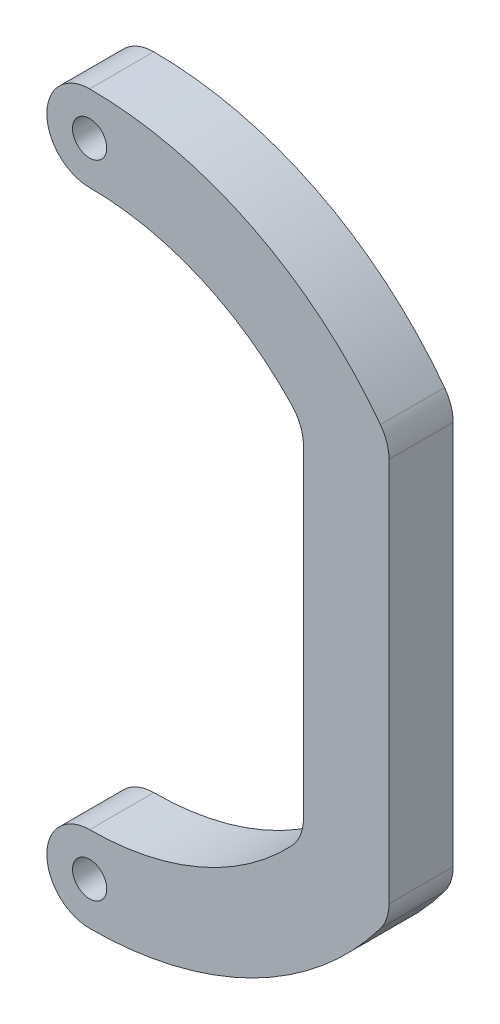
ISO-10303-21;
HEADER;
FILE_DESCRIPTION(('STEP AP214'),'2;1');
FILE_NAME('part.step','',(''),(''),'','','');
FILE_SCHEMA(('AUTOMOTIVE_DESIGN { 1 0 10303 214 1 1 1 1 }'));
ENDSEC;
DATA;
#1=APPLICATION_CONTEXT('core data for automotive mechanical design processes');
#2=APPLICATION_PROTOCOL_DEFINITION('international standard','automotive_design',2000,#1);
#3=PRODUCT_CONTEXT('',#1,'mechanical');
#4=PRODUCT('Part','Part','',(#3));
#5=PRODUCT_RELATED_PRODUCT_CATEGORY('part','',(#4));
#6=PRODUCT_DEFINITION_FORMATION('','',#4);
#7=PRODUCT_DEFINITION_CONTEXT('part definition',#1,'design');
#8=PRODUCT_DEFINITION('design','',#6,#7);
#9=PRODUCT_DEFINITION_SHAPE('','',#8);
#10=(LENGTH_UNIT() NAMED_UNIT(*) SI_UNIT(.MILLI.,.METRE.));
#11=(NAMED_UNIT(*) PLANE_ANGLE_UNIT() SI_UNIT($,.RADIAN.));
#12=(NAMED_UNIT(*) SI_UNIT($,.STERADIAN.) SOLID_ANGLE_UNIT());
#13=UNCERTAINTY_MEASURE_WITH_UNIT(LENGTH_MEASURE(1.E-05),#10,'distance_accuracy_value','');
#14=(GEOMETRIC_REPRESENTATION_CONTEXT(3) GLOBAL_UNCERTAINTY_ASSIGNED_CONTEXT((#13)) GLOBAL_UNIT_ASSIGNED_CONTEXT((#10,
#11,#12)) REPRESENTATION_CONTEXT('',''));
#15=CARTESIAN_POINT('',(0.,0.,0.));
#16=DIRECTION('',(0.,0.,1.));
#17=DIRECTION('',(1.,0.,0.));
#18=AXIS2_PLACEMENT_3D('',#15,#16,#17);
#19=CARTESIAN_POINT('',(-75.,-142.,15.));
#20=DIRECTION('',(0.,0.,-1.));
#21=DIRECTION('',(-1.,0.,0.));
#22=AXIS2_PLACEMENT_3D('',#19,#20,#21);
#23=PLANE('',#22);
#24=CARTESIAN_POINT('',(-75.,-142.,15.));
#25=DIRECTION('',(0.,0.,1.));
#26=DIRECTION('',(1.,0.,0.));
#27=AXIS2_PLACEMENT_3D('',#24,#25,#26);
#28=CIRCLE('',#27,3.99999999999999);
#29=CARTESIAN_POINT('',(-71.,-142.,15.));
#30=VERTEX_POINT('',#29);
#31=EDGE_CURVE('E157',#30,#30,#28,.T.);
#32=ORIENTED_EDGE('',*,*,#31,.F.);
#33=EDGE_LOOP('',(#32));
#34=FACE_BOUND('',#33,.T.);
#35=CARTESIAN_POINT('',(-75.,-142.,15.));
#36=DIRECTION('',(0.,0.,1.));
#37=DIRECTION('',(-1.,0.,0.));
#38=AXIS2_PLACEMENT_3D('',#35,#36,#37);
#39=CIRCLE('',#38,10.);
#40=CARTESIAN_POINT('',(-75.,-132.,15.));
#41=VERTEX_POINT('',#40);
#42=CARTESIAN_POINT('',(-75.,-152.,15.));
#43=VERTEX_POINT('',#42);
#44=EDGE_CURVE('E176',#41,#43,#39,.T.);
#45=ORIENTED_EDGE('',*,*,#44,.T.);
#46=CARTESIAN_POINT('',(-75.,-67.,15.));
#47=DIRECTION('',(0.,0.,1.));
#48=DIRECTION('',(1.,0.,0.));
#49=AXIS2_PLACEMENT_3D('',#46,#47,#48);
#50=CIRCLE('',#49,85.);
#51=CARTESIAN_POINT('',(-6.99999999999999,-118.,15.));
#52=VERTEX_POINT('',#51);
#53=EDGE_CURVE('E104',#43,#52,#50,.T.);
#54=ORIENTED_EDGE('',*,*,#53,.T.);
#55=CARTESIAN_POINT('',(-15.,-112.,15.));
#56=DIRECTION('',(0.,0.,1.));
#57=DIRECTION('',(1.,0.,0.));
#58=AXIS2_PLACEMENT_3D('',#55,#56,#57);
#59=CIRCLE('',#58,10.);
#60=CARTESIAN_POINT('',(-4.99999999999999,-112.,15.));
#61=VERTEX_POINT('',#60);
#62=EDGE_CURVE('E203',#52,#61,#59,.T.);
#63=ORIENTED_EDGE('',*,*,#62,.T.);
#64=DIRECTION('',(0.,1.,0.));
#65=VECTOR('',#64,1.);
#66=CARTESIAN_POINT('',(-4.99999999999999,-22.,15.));
#67=LINE('',#66,#65);
#68=CARTESIAN_POINT('',(-4.99999999999999,-22.,15.));
#69=VERTEX_POINT('',#68);
#70=EDGE_CURVE('E222',#61,#69,#67,.T.);
#71=ORIENTED_EDGE('',*,*,#70,.T.);
#72=CARTESIAN_POINT('',(-15.,-22.,15.));
#73=DIRECTION('',(0.,0.,1.));
#74=DIRECTION('',(-1.,0.,0.));
#75=AXIS2_PLACEMENT_3D('',#72,#73,#74);
#76=CIRCLE('',#75,10.);
#77=CARTESIAN_POINT('',(-6.99999999999999,-16.,15.));
#78=VERTEX_POINT('',#77);
#79=EDGE_CURVE('E219',#69,#78,#76,.T.);
#80=ORIENTED_EDGE('',*,*,#79,.T.);
#81=CARTESIAN_POINT('',(-75.,-67.,15.));
#82=DIRECTION('',(0.,0.,1.));
#83=DIRECTION('',(1.,0.,0.));
#84=AXIS2_PLACEMENT_3D('',#81,#82,#83);
#85=CIRCLE('',#84,85.);
#86=CARTESIAN_POINT('',(-74.9999999999999,18.,15.));
#87=VERTEX_POINT('',#86);
#88=EDGE_CURVE('E221',#78,#87,#85,.T.);
#89=ORIENTED_EDGE('',*,*,#88,.T.);
#90=CARTESIAN_POINT('',(-75.,7.99999999999998,15.));
#91=DIRECTION('',(0.,0.,1.));
#92=DIRECTION('',(1.,0.,0.));
#93=AXIS2_PLACEMENT_3D('',#90,#91,#92);
#94=CIRCLE('',#93,9.99999999999999);
#95=CARTESIAN_POINT('',(-75.,-2.00000000000002,15.));
#96=VERTEX_POINT('',#95);
#97=EDGE_CURVE('E224',#87,#96,#94,.T.);
#98=ORIENTED_EDGE('',*,*,#97,.T.);
#99=CARTESIAN_POINT('',(-75.,-67.,15.));
#100=DIRECTION('',(0.,0.,-1.));
#101=DIRECTION('',(1.,0.,0.));
#102=AXIS2_PLACEMENT_3D('',#99,#100,#101);
#103=CIRCLE('',#102,65.);
#104=CARTESIAN_POINT('',(-27.7272727272727,-22.3873419734002,15.));
#105=VERTEX_POINT('',#104);
#106=EDGE_CURVE('E230',#96,#105,#103,.T.);
#107=ORIENTED_EDGE('',*,*,#106,.T.);
#108=CARTESIAN_POINT('',(-35.,-29.2508278236463,15.));
#109=DIRECTION('',(0.,0.,-1.));
#110=DIRECTION('',(1.,0.,0.));
#111=AXIS2_PLACEMENT_3D('',#108,#109,#110);
#112=CIRCLE('',#111,10.);
#113=CARTESIAN_POINT('',(-25.,-29.2508278236463,15.));
#114=VERTEX_POINT('',#113);
#115=EDGE_CURVE('E135',#105,#114,#112,.T.);
#116=ORIENTED_EDGE('',*,*,#115,.T.);
#117=DIRECTION('',(0.,-1.,0.));
#118=VECTOR('',#117,1.);
#119=CARTESIAN_POINT('',(-25.,-29.2508278236463,15.));
#120=LINE('',#119,#118);
#121=CARTESIAN_POINT('',(-25.,-104.749172176354,15.));
#122=VERTEX_POINT('',#121);
#123=EDGE_CURVE('E129',#114,#122,#120,.T.);
#124=ORIENTED_EDGE('',*,*,#123,.T.);
#125=CARTESIAN_POINT('',(-35.,-104.749172176354,15.));
#126=DIRECTION('',(0.,0.,-1.));
#127=DIRECTION('',(1.,0.,0.));
#128=AXIS2_PLACEMENT_3D('',#125,#126,#127);
#129=CIRCLE('',#128,10.);
#130=CARTESIAN_POINT('',(-27.7272727272727,-111.6126580266,15.));
#131=VERTEX_POINT('',#130);
#132=EDGE_CURVE('E133',#122,#131,#129,.T.);
#133=ORIENTED_EDGE('',*,*,#132,.T.);
#134=CARTESIAN_POINT('',(-75.,-67.,15.));
#135=DIRECTION('',(0.,0.,-1.));
#136=DIRECTION('',(1.,0.,0.));
#137=AXIS2_PLACEMENT_3D('',#134,#135,#136);
#138=CIRCLE('',#137,65.);
#139=EDGE_CURVE('E49',#131,#41,#138,.T.);
#140=ORIENTED_EDGE('',*,*,#139,.T.);
#141=EDGE_LOOP('',(#45,#54,#63,#71,#80,#89,#98,#107,#116,#124,#133,#140));
#142=FACE_BOUND('',#141,.T.);
#143=CARTESIAN_POINT('',(-75.,7.99999999999998,15.));
#144=DIRECTION('',(0.,0.,1.));
#145=DIRECTION('',(1.,0.,0.));
#146=AXIS2_PLACEMENT_3D('',#143,#144,#145);
#147=CIRCLE('',#146,4.00000000000001);
#148=CARTESIAN_POINT('',(-71.,7.99999999999998,15.));
#149=VERTEX_POINT('',#148);
#150=EDGE_CURVE('E273',#149,#149,#147,.T.);
#151=ORIENTED_EDGE('',*,*,#150,.F.);
#152=EDGE_LOOP('',(#151));
#153=FACE_BOUND('',#152,.T.);
#154=ADVANCED_FACE('F32',(#34,#142,#153),#23,.F.);
#155=CARTESIAN_POINT('',(-75.,-142.,0.));
#156=DIRECTION('',(0.,0.,-1.));
#157=DIRECTION('',(-1.,0.,0.));
#158=AXIS2_PLACEMENT_3D('',#155,#156,#157);
#159=PLANE('',#158);
#160=CARTESIAN_POINT('',(-75.,-142.,0.));
#161=DIRECTION('',(0.,0.,1.));
#162=DIRECTION('',(1.,0.,0.));
#163=AXIS2_PLACEMENT_3D('',#160,#161,#162);
#164=CIRCLE('',#163,3.99999999999999);
#165=CARTESIAN_POINT('',(-71.,-142.,0.));
#166=VERTEX_POINT('',#165);
#167=EDGE_CURVE('E278',#166,#166,#164,.T.);
#168=ORIENTED_EDGE('',*,*,#167,.T.);
#169=EDGE_LOOP('',(#168));
#170=FACE_BOUND('',#169,.T.);
#171=CARTESIAN_POINT('',(-75.,-142.,0.));
#172=DIRECTION('',(0.,0.,1.));
#173=DIRECTION('',(-1.,0.,0.));
#174=AXIS2_PLACEMENT_3D('',#171,#172,#173);
#175=CIRCLE('',#174,10.);
#176=CARTESIAN_POINT('',(-75.,-132.,0.));
#177=VERTEX_POINT('',#176);
#178=CARTESIAN_POINT('',(-75.,-152.,0.));
#179=VERTEX_POINT('',#178);
#180=EDGE_CURVE('E153',#177,#179,#175,.T.);
#181=ORIENTED_EDGE('',*,*,#180,.F.);
#182=CARTESIAN_POINT('',(-75.,-67.,0.));
#183=DIRECTION('',(0.,0.,-1.));
#184=DIRECTION('',(1.,0.,0.));
#185=AXIS2_PLACEMENT_3D('',#182,#183,#184);
#186=CIRCLE('',#185,65.);
#187=CARTESIAN_POINT('',(-27.7272727272727,-111.6126580266,0.));
#188=VERTEX_POINT('',#187);
#189=EDGE_CURVE('E96',#188,#177,#186,.T.);
#190=ORIENTED_EDGE('',*,*,#189,.F.);
#191=CARTESIAN_POINT('',(-35.,-104.749172176354,0.));
#192=DIRECTION('',(0.,0.,-1.));
#193=DIRECTION('',(1.,0.,0.));
#194=AXIS2_PLACEMENT_3D('',#191,#192,#193);
#195=CIRCLE('',#194,10.);
#196=CARTESIAN_POINT('',(-25.,-104.749172176354,0.));
#197=VERTEX_POINT('',#196);
#198=EDGE_CURVE('E90',#197,#188,#195,.T.);
#199=ORIENTED_EDGE('',*,*,#198,.F.);
#200=DIRECTION('',(0.,-1.,0.));
#201=VECTOR('',#200,1.);
#202=CARTESIAN_POINT('',(-25.,-29.2508278236463,0.));
#203=LINE('',#202,#201);
#204=CARTESIAN_POINT('',(-25.,-29.2508278236463,0.));
#205=VERTEX_POINT('',#204);
#206=EDGE_CURVE('E143',#205,#197,#203,.T.);
#207=ORIENTED_EDGE('',*,*,#206,.F.);
#208=CARTESIAN_POINT('',(-35.,-29.2508278236463,0.));
#209=DIRECTION('',(0.,0.,-1.));
#210=DIRECTION('',(1.,0.,0.));
#211=AXIS2_PLACEMENT_3D('',#208,#209,#210);
#212=CIRCLE('',#211,10.);
#213=CARTESIAN_POINT('',(-27.7272727272727,-22.3873419734002,0.));
#214=VERTEX_POINT('',#213);
#215=EDGE_CURVE('E171',#214,#205,#212,.T.);
#216=ORIENTED_EDGE('',*,*,#215,.F.);
#217=CARTESIAN_POINT('',(-75.,-67.,0.));
#218=DIRECTION('',(0.,0.,-1.));
#219=DIRECTION('',(1.,0.,0.));
#220=AXIS2_PLACEMENT_3D('',#217,#218,#219);
#221=CIRCLE('',#220,65.);
#222=CARTESIAN_POINT('',(-75.,-2.00000000000002,0.));
#223=VERTEX_POINT('',#222);
#224=EDGE_CURVE('E169',#223,#214,#221,.T.);
#225=ORIENTED_EDGE('',*,*,#224,.F.);
#226=CARTESIAN_POINT('',(-75.,7.99999999999998,0.));
#227=DIRECTION('',(0.,0.,1.));
#228=DIRECTION('',(1.,0.,0.));
#229=AXIS2_PLACEMENT_3D('',#226,#227,#228);
#230=CIRCLE('',#229,9.99999999999999);
#231=CARTESIAN_POINT('',(-74.9999999999999,18.,0.));
#232=VERTEX_POINT('',#231);
#233=EDGE_CURVE('E167',#232,#223,#230,.T.);
#234=ORIENTED_EDGE('',*,*,#233,.F.);
#235=CARTESIAN_POINT('',(-75.,-67.,0.));
#236=DIRECTION('',(0.,0.,1.));
#237=DIRECTION('',(1.,0.,0.));
#238=AXIS2_PLACEMENT_3D('',#235,#236,#237);
#239=CIRCLE('',#238,85.);
#240=CARTESIAN_POINT('',(-6.99999999999999,-16.,0.));
#241=VERTEX_POINT('',#240);
#242=EDGE_CURVE('E165',#241,#232,#239,.T.);
#243=ORIENTED_EDGE('',*,*,#242,.F.);
#244=CARTESIAN_POINT('',(-15.,-22.,0.));
#245=DIRECTION('',(0.,0.,1.));
#246=DIRECTION('',(-1.,0.,0.));
#247=AXIS2_PLACEMENT_3D('',#244,#245,#246);
#248=CIRCLE('',#247,10.);
#249=CARTESIAN_POINT('',(-4.99999999999999,-22.,0.));
#250=VERTEX_POINT('',#249);
#251=EDGE_CURVE('E163',#250,#241,#248,.T.);
#252=ORIENTED_EDGE('',*,*,#251,.F.);
#253=DIRECTION('',(0.,1.,0.));
#254=VECTOR('',#253,1.);
#255=CARTESIAN_POINT('',(-4.99999999999999,-22.,0.));
#256=LINE('',#255,#254);
#257=CARTESIAN_POINT('',(-4.99999999999999,-112.,0.));
#258=VERTEX_POINT('',#257);
#259=EDGE_CURVE('E161',#258,#250,#256,.T.);
#260=ORIENTED_EDGE('',*,*,#259,.F.);
#261=CARTESIAN_POINT('',(-15.,-112.,0.));
#262=DIRECTION('',(0.,0.,1.));
#263=DIRECTION('',(1.,0.,0.));
#264=AXIS2_PLACEMENT_3D('',#261,#262,#263);
#265=CIRCLE('',#264,10.);
#266=CARTESIAN_POINT('',(-6.99999999999999,-118.,0.));
#267=VERTEX_POINT('',#266);
#268=EDGE_CURVE('E159',#267,#258,#265,.T.);
#269=ORIENTED_EDGE('',*,*,#268,.F.);
#270=CARTESIAN_POINT('',(-75.,-67.,0.));
#271=DIRECTION('',(0.,0.,1.));
#272=DIRECTION('',(1.,0.,0.));
#273=AXIS2_PLACEMENT_3D('',#270,#271,#272);
#274=CIRCLE('',#273,85.);
#275=EDGE_CURVE('E156',#179,#267,#274,.T.);
#276=ORIENTED_EDGE('',*,*,#275,.F.);
#277=EDGE_LOOP('',(#181,#190,#199,#207,#216,#225,#234,#243,#252,#260,#269,#276));
#278=FACE_BOUND('',#277,.T.);
#279=CARTESIAN_POINT('',(-75.,7.99999999999998,0.));
#280=DIRECTION('',(0.,0.,1.));
#281=DIRECTION('',(1.,0.,0.));
#282=AXIS2_PLACEMENT_3D('',#279,#280,#281);
#283=CIRCLE('',#282,4.00000000000001);
#284=CARTESIAN_POINT('',(-71.,7.99999999999998,0.));
#285=VERTEX_POINT('',#284);
#286=EDGE_CURVE('E276',#285,#285,#283,.T.);
#287=ORIENTED_EDGE('',*,*,#286,.T.);
#288=EDGE_LOOP('',(#287));
#289=FACE_BOUND('',#288,.T.);
#290=ADVANCED_FACE('F207',(#170,#278,#289),#159,.T.);
#291=CARTESIAN_POINT('',(-75.,-142.,15.));
#292=DIRECTION('',(0.,0.,-1.));
#293=DIRECTION('',(-1.,0.,0.));
#294=AXIS2_PLACEMENT_3D('',#291,#292,#293);
#295=CYLINDRICAL_SURFACE('',#294,10.);
#296=ORIENTED_EDGE('',*,*,#180,.T.);
#297=DIRECTION('',(0.,0.,-1.));
#298=VECTOR('',#297,1.);
#299=CARTESIAN_POINT('',(-75.,-152.,15.));
#300=LINE('',#299,#298);
#301=EDGE_CURVE('E11',#43,#179,#300,.T.);
#302=ORIENTED_EDGE('',*,*,#301,.F.);
#303=ORIENTED_EDGE('',*,*,#44,.F.);
#304=DIRECTION('',(0.,0.,-1.));
#305=VECTOR('',#304,1.);
#306=CARTESIAN_POINT('',(-75.,-132.,15.));
#307=LINE('',#306,#305);
#308=EDGE_CURVE('E149',#41,#177,#307,.T.);
#309=ORIENTED_EDGE('',*,*,#308,.T.);
#310=EDGE_LOOP('',(#296,#302,#303,#309));
#311=FACE_BOUND('',#310,.T.);
#312=ADVANCED_FACE('F34',(#311),#295,.T.);
#313=CARTESIAN_POINT('',(-75.,-67.,15.));
#314=DIRECTION('',(0.,0.,-1.));
#315=DIRECTION('',(-1.,0.,0.));
#316=AXIS2_PLACEMENT_3D('',#313,#314,#315);
#317=CYLINDRICAL_SURFACE('',#316,85.);
#318=ORIENTED_EDGE('',*,*,#275,.T.);
#319=DIRECTION('',(0.,0.,-1.));
#320=VECTOR('',#319,1.);
#321=CARTESIAN_POINT('',(-6.99999999999999,-118.,15.));
#322=LINE('',#321,#320);
#323=EDGE_CURVE('E41',#52,#267,#322,.T.);
#324=ORIENTED_EDGE('',*,*,#323,.F.);
#325=ORIENTED_EDGE('',*,*,#53,.F.);
#326=ORIENTED_EDGE('',*,*,#301,.T.);
#327=EDGE_LOOP('',(#318,#324,#325,#326));
#328=FACE_BOUND('',#327,.T.);
#329=ADVANCED_FACE('F371',(#328),#317,.T.);
#330=CARTESIAN_POINT('',(-15.,-112.,15.));
#331=DIRECTION('',(0.,0.,-1.));
#332=DIRECTION('',(-1.,0.,0.));
#333=AXIS2_PLACEMENT_3D('',#330,#331,#332);
#334=CYLINDRICAL_SURFACE('',#333,10.);
#335=ORIENTED_EDGE('',*,*,#268,.T.);
#336=DIRECTION('',(0.,0.,-1.));
#337=VECTOR('',#336,1.);
#338=CARTESIAN_POINT('',(-4.99999999999999,-112.,15.));
#339=LINE('',#338,#337);
#340=EDGE_CURVE('E195',#61,#258,#339,.T.);
#341=ORIENTED_EDGE('',*,*,#340,.F.);
#342=ORIENTED_EDGE('',*,*,#62,.F.);
#343=ORIENTED_EDGE('',*,*,#323,.T.);
#344=EDGE_LOOP('',(#335,#341,#342,#343));
#345=FACE_BOUND('',#344,.T.);
#346=ADVANCED_FACE('F201',(#345),#334,.T.);
#347=CARTESIAN_POINT('',(-4.99999999999999,-22.,15.));
#348=DIRECTION('',(-1.,0.,0.));
#349=DIRECTION('',(0.,0.,1.));
#350=AXIS2_PLACEMENT_3D('',#347,#348,#349);
#351=PLANE('',#350);
#352=ORIENTED_EDGE('',*,*,#259,.T.);
#353=DIRECTION('',(0.,0.,-1.));
#354=VECTOR('',#353,1.);
#355=CARTESIAN_POINT('',(-4.99999999999999,-22.,15.));
#356=LINE('',#355,#354);
#357=EDGE_CURVE('E192',#69,#250,#356,.T.);
#358=ORIENTED_EDGE('',*,*,#357,.F.);
#359=ORIENTED_EDGE('',*,*,#70,.F.);
#360=ORIENTED_EDGE('',*,*,#340,.T.);
#361=EDGE_LOOP('',(#352,#358,#359,#360));
#362=FACE_BOUND('',#361,.T.);
#363=ADVANCED_FACE('F213',(#362),#351,.F.);
#364=CARTESIAN_POINT('',(-15.,-22.,15.));
#365=DIRECTION('',(0.,0.,-1.));
#366=DIRECTION('',(-1.,0.,0.));
#367=AXIS2_PLACEMENT_3D('',#364,#365,#366);
#368=CYLINDRICAL_SURFACE('',#367,10.);
#369=ORIENTED_EDGE('',*,*,#251,.T.);
#370=DIRECTION('',(0.,0.,-1.));
#371=VECTOR('',#370,1.);
#372=CARTESIAN_POINT('',(-6.99999999999999,-16.,15.));
#373=LINE('',#372,#371);
#374=EDGE_CURVE('E189',#78,#241,#373,.T.);
#375=ORIENTED_EDGE('',*,*,#374,.F.);
#376=ORIENTED_EDGE('',*,*,#79,.F.);
#377=ORIENTED_EDGE('',*,*,#357,.T.);
#378=EDGE_LOOP('',(#369,#375,#376,#377));
#379=FACE_BOUND('',#378,.T.);
#380=ADVANCED_FACE('F217',(#379),#368,.T.);
#381=CARTESIAN_POINT('',(-75.,-67.,15.));
#382=DIRECTION('',(0.,0.,-1.));
#383=DIRECTION('',(-1.,0.,0.));
#384=AXIS2_PLACEMENT_3D('',#381,#382,#383);
#385=CYLINDRICAL_SURFACE('',#384,85.);
#386=ORIENTED_EDGE('',*,*,#242,.T.);
#387=DIRECTION('',(0.,0.,-1.));
#388=VECTOR('',#387,1.);
#389=CARTESIAN_POINT('',(-74.9999999999999,18.,15.));
#390=LINE('',#389,#388);
#391=EDGE_CURVE('E186',#87,#232,#390,.T.);
#392=ORIENTED_EDGE('',*,*,#391,.F.);
#393=ORIENTED_EDGE('',*,*,#88,.F.);
#394=ORIENTED_EDGE('',*,*,#374,.T.);
#395=EDGE_LOOP('',(#386,#392,#393,#394));
#396=FACE_BOUND('',#395,.T.);
#397=ADVANCED_FACE('F336',(#396),#385,.T.);
#398=CARTESIAN_POINT('',(-75.,7.99999999999998,15.));
#399=DIRECTION('',(0.,0.,-1.));
#400=DIRECTION('',(-1.,0.,0.));
#401=AXIS2_PLACEMENT_3D('',#398,#399,#400);
#402=CYLINDRICAL_SURFACE('',#401,9.99999999999999);
#403=ORIENTED_EDGE('',*,*,#233,.T.);
#404=DIRECTION('',(0.,0.,-1.));
#405=VECTOR('',#404,1.);
#406=CARTESIAN_POINT('',(-75.,-2.00000000000002,15.));
#407=LINE('',#406,#405);
#408=EDGE_CURVE('E183',#96,#223,#407,.T.);
#409=ORIENTED_EDGE('',*,*,#408,.F.);
#410=ORIENTED_EDGE('',*,*,#97,.F.);
#411=ORIENTED_EDGE('',*,*,#391,.T.);
#412=EDGE_LOOP('',(#403,#409,#410,#411));
#413=FACE_BOUND('',#412,.T.);
#414=ADVANCED_FACE('F327',(#413),#402,.T.);
#415=CARTESIAN_POINT('',(-75.,-67.,15.));
#416=DIRECTION('',(0.,0.,-1.));
#417=DIRECTION('',(-1.,0.,0.));
#418=AXIS2_PLACEMENT_3D('',#415,#416,#417);
#419=CYLINDRICAL_SURFACE('',#418,65.);
#420=ORIENTED_EDGE('',*,*,#224,.T.);
#421=DIRECTION('',(0.,0.,-1.));
#422=VECTOR('',#421,1.);
#423=CARTESIAN_POINT('',(-27.7272727272727,-22.3873419734002,15.));
#424=LINE('',#423,#422);
#425=EDGE_CURVE('E180',#105,#214,#424,.T.);
#426=ORIENTED_EDGE('',*,*,#425,.F.);
#427=ORIENTED_EDGE('',*,*,#106,.F.);
#428=ORIENTED_EDGE('',*,*,#408,.T.);
#429=EDGE_LOOP('',(#420,#426,#427,#428));
#430=FACE_BOUND('',#429,.T.);
#431=ADVANCED_FACE('F236',(#430),#419,.F.);
#432=CARTESIAN_POINT('',(-35.,-29.2508278236463,15.));
#433=DIRECTION('',(0.,0.,-1.));
#434=DIRECTION('',(-1.,0.,0.));
#435=AXIS2_PLACEMENT_3D('',#432,#433,#434);
#436=CYLINDRICAL_SURFACE('',#435,10.);
#437=ORIENTED_EDGE('',*,*,#215,.T.);
#438=DIRECTION('',(0.,0.,-1.));
#439=VECTOR('',#438,1.);
#440=CARTESIAN_POINT('',(-25.,-29.2508278236463,15.));
#441=LINE('',#440,#439);
#442=EDGE_CURVE('E144',#114,#205,#441,.T.);
#443=ORIENTED_EDGE('',*,*,#442,.F.);
#444=ORIENTED_EDGE('',*,*,#115,.F.);
#445=ORIENTED_EDGE('',*,*,#425,.T.);
#446=EDGE_LOOP('',(#437,#443,#444,#445));
#447=FACE_BOUND('',#446,.T.);
#448=ADVANCED_FACE('F240',(#447),#436,.F.);
#449=CARTESIAN_POINT('',(-25.,-29.2508278236463,15.));
#450=DIRECTION('',(1.,0.,0.));
#451=DIRECTION('',(0.,0.,-1.));
#452=AXIS2_PLACEMENT_3D('',#449,#450,#451);
#453=PLANE('',#452);
#454=ORIENTED_EDGE('',*,*,#206,.T.);
#455=DIRECTION('',(0.,0.,-1.));
#456=VECTOR('',#455,1.);
#457=CARTESIAN_POINT('',(-25.,-104.749172176354,15.));
#458=LINE('',#457,#456);
#459=EDGE_CURVE('E140',#122,#197,#458,.T.);
#460=ORIENTED_EDGE('',*,*,#459,.F.);
#461=ORIENTED_EDGE('',*,*,#123,.F.);
#462=ORIENTED_EDGE('',*,*,#442,.T.);
#463=EDGE_LOOP('',(#454,#460,#461,#462));
#464=FACE_BOUND('',#463,.T.);
#465=ADVANCED_FACE('F141',(#464),#453,.F.);
#466=CARTESIAN_POINT('',(-35.,-104.749172176354,15.));
#467=DIRECTION('',(0.,0.,-1.));
#468=DIRECTION('',(-1.,0.,0.));
#469=AXIS2_PLACEMENT_3D('',#466,#467,#468);
#470=CYLINDRICAL_SURFACE('',#469,10.);
#471=ORIENTED_EDGE('',*,*,#198,.T.);
#472=DIRECTION('',(0.,0.,-1.));
#473=VECTOR('',#472,1.);
#474=CARTESIAN_POINT('',(-27.7272727272727,-111.6126580266,15.));
#475=LINE('',#474,#473);
#476=EDGE_CURVE('E145',#131,#188,#475,.T.);
#477=ORIENTED_EDGE('',*,*,#476,.F.);
#478=ORIENTED_EDGE('',*,*,#132,.F.);
#479=ORIENTED_EDGE('',*,*,#459,.T.);
#480=EDGE_LOOP('',(#471,#477,#478,#479));
#481=FACE_BOUND('',#480,.T.);
#482=ADVANCED_FACE('F147',(#481),#470,.F.);
#483=CARTESIAN_POINT('',(-75.,-67.,15.));
#484=DIRECTION('',(0.,0.,-1.));
#485=DIRECTION('',(-1.,0.,0.));
#486=AXIS2_PLACEMENT_3D('',#483,#484,#485);
#487=CYLINDRICAL_SURFACE('',#486,65.);
#488=ORIENTED_EDGE('',*,*,#189,.T.);
#489=ORIENTED_EDGE('',*,*,#308,.F.);
#490=ORIENTED_EDGE('',*,*,#139,.F.);
#491=ORIENTED_EDGE('',*,*,#476,.T.);
#492=EDGE_LOOP('',(#488,#489,#490,#491));
#493=FACE_BOUND('',#492,.T.);
#494=ADVANCED_FACE('F244',(#493),#487,.F.);
#495=CARTESIAN_POINT('',(-75.,-142.,15.));
#496=DIRECTION('',(0.,0.,-1.));
#497=DIRECTION('',(-1.,0.,0.));
#498=AXIS2_PLACEMENT_3D('',#495,#496,#497);
#499=CYLINDRICAL_SURFACE('',#498,3.99999999999999);
#500=ORIENTED_EDGE('',*,*,#31,.T.);
#501=EDGE_LOOP('',(#500));
#502=FACE_BOUND('',#501,.T.);
#503=ORIENTED_EDGE('',*,*,#167,.F.);
#504=EDGE_LOOP('',(#503));
#505=FACE_BOUND('',#504,.T.);
#506=ADVANCED_FACE('F246',(#502,#505),#499,.F.);
#507=CARTESIAN_POINT('',(-75.,7.99999999999998,15.));
#508=DIRECTION('',(0.,0.,-1.));
#509=DIRECTION('',(-1.,0.,0.));
#510=AXIS2_PLACEMENT_3D('',#507,#508,#509);
#511=CYLINDRICAL_SURFACE('',#510,4.00000000000001);
#512=ORIENTED_EDGE('',*,*,#150,.T.);
#513=EDGE_LOOP('',(#512));
#514=FACE_BOUND('',#513,.T.);
#515=ORIENTED_EDGE('',*,*,#286,.F.);
#516=EDGE_LOOP('',(#515));
#517=FACE_BOUND('',#516,.T.);
#518=ADVANCED_FACE('F252',(#514,#517),#511,.F.);
#519=CLOSED_SHELL('',(#154,#290,#312,#329,#346,#363,#380,#397,#414,#431,#448,#465,#482,#494,
#506,#518));
#520=MANIFOLD_SOLID_BREP('B2',#519);
#521=ADVANCED_BREP_SHAPE_REPRESENTATION('',(#18,#520),#14);
#522=SHAPE_DEFINITION_REPRESENTATION(#9,#521);
ENDSEC;
END-ISO-10303-21;
